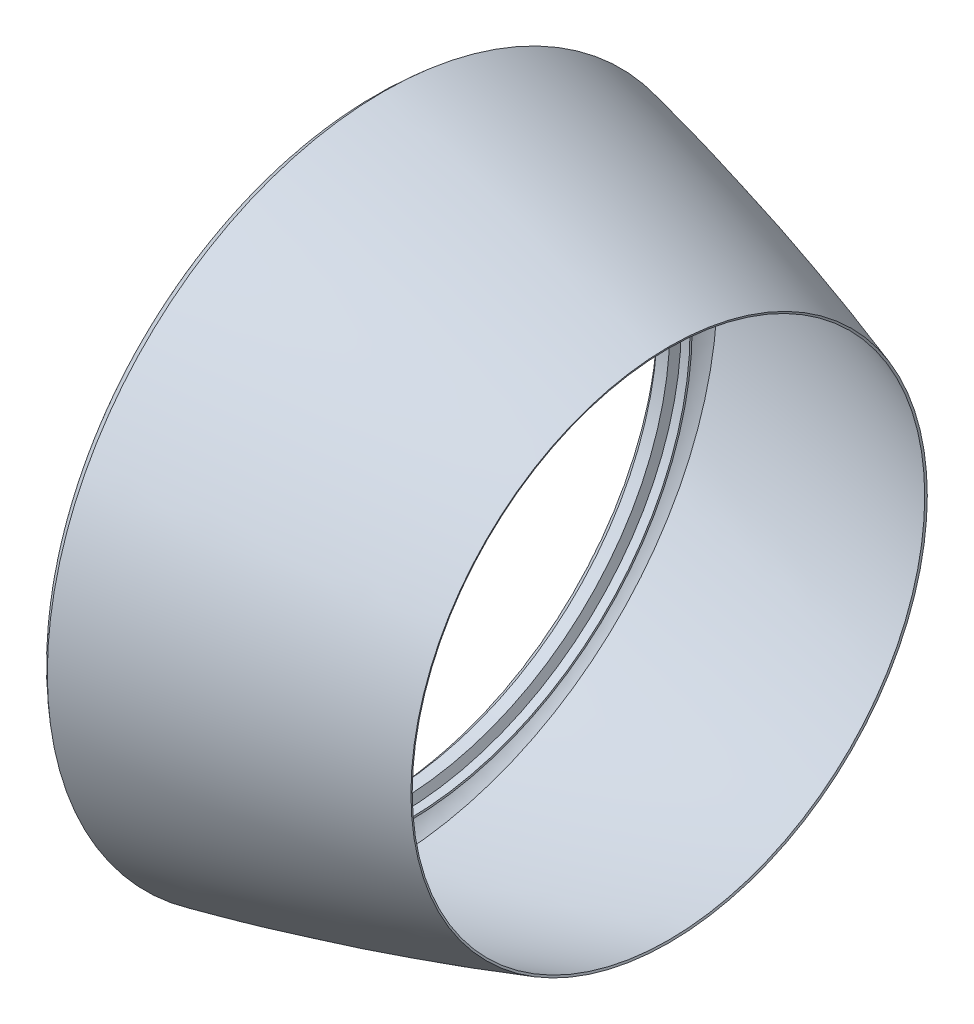
ISO-10303-21;
HEADER;
FILE_DESCRIPTION(('STEP AP214'),'2;1');
FILE_NAME('part.step','',(''),(''),'','','');
FILE_SCHEMA(('AUTOMOTIVE_DESIGN { 1 0 10303 214 1 1 1 1 }'));
ENDSEC;
DATA;
#1=APPLICATION_CONTEXT('core data for automotive mechanical design processes');
#2=APPLICATION_PROTOCOL_DEFINITION('international standard','automotive_design',2000,#1);
#3=PRODUCT_CONTEXT('',#1,'mechanical');
#4=PRODUCT('Part','Part','',(#3));
#5=PRODUCT_RELATED_PRODUCT_CATEGORY('part','',(#4));
#6=PRODUCT_DEFINITION_FORMATION('','',#4);
#7=PRODUCT_DEFINITION_CONTEXT('part definition',#1,'design');
#8=PRODUCT_DEFINITION('design','',#6,#7);
#9=PRODUCT_DEFINITION_SHAPE('','',#8);
#10=(LENGTH_UNIT() NAMED_UNIT(*) SI_UNIT(.MILLI.,.METRE.));
#11=(NAMED_UNIT(*) PLANE_ANGLE_UNIT() SI_UNIT($,.RADIAN.));
#12=(NAMED_UNIT(*) SI_UNIT($,.STERADIAN.) SOLID_ANGLE_UNIT());
#13=UNCERTAINTY_MEASURE_WITH_UNIT(LENGTH_MEASURE(1.E-05),#10,'distance_accuracy_value','');
#14=(GEOMETRIC_REPRESENTATION_CONTEXT(3) GLOBAL_UNCERTAINTY_ASSIGNED_CONTEXT((#13)) GLOBAL_UNIT_ASSIGNED_CONTEXT((#10,
#11,#12)) REPRESENTATION_CONTEXT('',''));
#15=CARTESIAN_POINT('',(0.,0.,0.));
#16=DIRECTION('',(0.,0.,1.));
#17=DIRECTION('',(1.,0.,0.));
#18=AXIS2_PLACEMENT_3D('',#15,#16,#17);
#19=CARTESIAN_POINT('',(58.1645223558109,0.,0.));
#20=DIRECTION('',(-1.,0.,0.));
#21=DIRECTION('',(0.,0.,1.));
#22=AXIS2_PLACEMENT_3D('',#19,#20,#21);
#23=PLANE('',#22);
#24=CARTESIAN_POINT('',(58.1645223558109,0.,0.));
#25=DIRECTION('',(1.,0.,0.));
#26=DIRECTION('',(0.,0.,-1.));
#27=AXIS2_PLACEMENT_3D('',#24,#25,#26);
#28=CIRCLE('',#27,695.);
#29=CARTESIAN_POINT('',(58.1645223558109,0.,-695.));
#30=VERTEX_POINT('',#29);
#31=EDGE_CURVE('E51',#30,#30,#28,.T.);
#32=ORIENTED_EDGE('',*,*,#31,.F.);
#33=EDGE_LOOP('',(#32));
#34=FACE_BOUND('',#33,.T.);
#35=CARTESIAN_POINT('',(58.1645223558109,0.,0.));
#36=DIRECTION('',(1.,0.,0.));
#37=DIRECTION('',(0.,0.,-1.));
#38=AXIS2_PLACEMENT_3D('',#35,#36,#37);
#39=CIRCLE('',#38,700.);
#40=CARTESIAN_POINT('',(58.1645223558109,0.,-700.));
#41=VERTEX_POINT('',#40);
#42=EDGE_CURVE('E114',#41,#41,#39,.T.);
#43=ORIENTED_EDGE('',*,*,#42,.T.);
#44=EDGE_LOOP('',(#43));
#45=FACE_BOUND('',#44,.T.);
#46=ADVANCED_FACE('F33',(#34,#45),#23,.F.);
#47=CARTESIAN_POINT('',(700.,0.,0.));
#48=DIRECTION('',(1.,0.,0.));
#49=DIRECTION('',(0.,0.,-1.));
#50=AXIS2_PLACEMENT_3D('',#47,#48,#49);
#51=CONICAL_SURFACE('',#50,630.,1.25034413133825);
#52=CARTESIAN_POINT('',(701.574978841917,0.,0.));
#53=DIRECTION('',(1.,0.,0.));
#54=DIRECTION('',(0.,1.,0.));
#55=AXIS2_PLACEMENT_3D('',#52,#53,#54);
#56=CIRCLE('',#55,634.745465377338);
#57=CARTESIAN_POINT('',(701.574978841917,634.745465377338,0.));
#58=VERTEX_POINT('',#57);
#59=EDGE_CURVE('E10',#58,#58,#56,.T.);
#60=ORIENTED_EDGE('',*,*,#59,.T.);
#61=EDGE_LOOP('',(#60));
#62=FACE_BOUND('',#61,.T.);
#63=CARTESIAN_POINT('',(700.,0.,0.));
#64=DIRECTION('',(1.,0.,0.));
#65=DIRECTION('',(0.,0.,-1.));
#66=AXIS2_PLACEMENT_3D('',#63,#64,#65);
#67=CIRCLE('',#66,630.);
#68=CARTESIAN_POINT('',(700.,0.,-630.));
#69=VERTEX_POINT('',#68);
#70=EDGE_CURVE('E36',#69,#69,#67,.T.);
#71=ORIENTED_EDGE('',*,*,#70,.F.);
#72=EDGE_LOOP('',(#71));
#73=FACE_BOUND('',#72,.T.);
#74=ADVANCED_FACE('F150',(#62,#73),#51,.F.);
#75=CARTESIAN_POINT('',(700.,630.,0.));
#76=CARTESIAN_POINT('',(355.230240406116,744.42609597077,0.));
#77=CARTESIAN_POINT('',(-3.55230240406116,821.163523456643,0.));
#78=CARTESIAN_POINT('',(-7.10460480812233,821.923299966404,0.));
#79=B_SPLINE_CURVE_WITH_KNOTS('',2,(#75,#76,#77,#78),.UNSPECIFIED.,.F.,.F.,(3,1,3),(0.,1.,1.01),.UNSPECIFIED.);
#80=CARTESIAN_POINT('',(0.,0.,0.));
#81=DIRECTION('',(1.,0.,0.));
#82=AXIS1_PLACEMENT('',#80,#81);
#83=SURFACE_OF_REVOLUTION('',#79,#82);
#84=OFFSET_SURFACE('',#83,-5.,.F.);
#85=CARTESIAN_POINT('',(-1.27214763729724,0.,0.));
#86=DIRECTION('',(1.,0.,0.));
#87=DIRECTION('',(0.,0.,-1.));
#88=AXIS2_PLACEMENT_3D('',#85,#86,#87);
#89=CIRCLE('',#88,825.788923317944);
#90=CARTESIAN_POINT('',(-1.27214763729724,0.,-825.788923317944));
#91=VERTEX_POINT('',#90);
#92=EDGE_CURVE('E40',#91,#91,#89,.T.);
#93=ORIENTED_EDGE('',*,*,#92,.T.);
#94=EDGE_LOOP('',(#93));
#95=FACE_BOUND('',#94,.T.);
#96=ORIENTED_EDGE('',*,*,#59,.F.);
#97=EDGE_LOOP('',(#96));
#98=FACE_BOUND('',#97,.T.);
#99=ADVANCED_FACE('F70',(#95,#98),#84,.F.);
#100=CARTESIAN_POINT('',(1.85103209677286,821.884342886106,0.));
#101=CARTESIAN_POINT('',(0.925516048386431,821.144044916494,0.));
#102=CARTESIAN_POINT('',(-82.2230250655234,754.635531887298,0.));
#103=CARTESIAN_POINT('',(0.822230250655234,679.253644681127,0.));
#104=CARTESIAN_POINT('',(1.64446050131047,678.507289362254,0.));
#105=B_SPLINE_CURVE_WITH_KNOTS('',2,(#100,#101,#102,#103,#104),.UNSPECIFIED.,.F.,.F.,(3,1,1,3),
(-0.0112561663554569,0.,1.,1.01),.UNSPECIFIED.);
#106=CARTESIAN_POINT('',(0.,0.,0.));
#107=DIRECTION('',(1.,0.,0.));
#108=AXIS1_PLACEMENT('',#106,#107);
#109=SURFACE_OF_REVOLUTION('',#105,#108);
#110=OFFSET_SURFACE('',#109,-5.,.F.);
#111=CARTESIAN_POINT('',(-1.93087718880677,0.,0.));
#112=DIRECTION('',(1.,0.,0.));
#113=DIRECTION('',(0.,0.,-1.));
#114=AXIS2_PLACEMENT_3D('',#111,#112,#113);
#115=CIRCLE('',#114,675.);
#116=CARTESIAN_POINT('',(-1.93087718880677,0.,-675.));
#117=VERTEX_POINT('',#116);
#118=EDGE_CURVE('E45',#117,#117,#115,.T.);
#119=ORIENTED_EDGE('',*,*,#118,.T.);
#120=EDGE_LOOP('',(#119));
#121=FACE_BOUND('',#120,.T.);
#122=ORIENTED_EDGE('',*,*,#92,.F.);
#123=EDGE_LOOP('',(#122));
#124=FACE_BOUND('',#123,.T.);
#125=ADVANCED_FACE('F71',(#121,#124),#110,.F.);
#126=CARTESIAN_POINT('',(0.,0.,0.));
#127=DIRECTION('',(1.,0.,0.));
#128=DIRECTION('',(0.,0.,-1.));
#129=AXIS2_PLACEMENT_3D('',#126,#127,#128);
#130=CYLINDRICAL_SURFACE('',#129,675.);
#131=CARTESIAN_POINT('',(28.3594447582819,0.,0.));
#132=DIRECTION('',(1.,0.,0.));
#133=DIRECTION('',(0.,0.,-1.));
#134=AXIS2_PLACEMENT_3D('',#131,#132,#133);
#135=CIRCLE('',#134,675.);
#136=CARTESIAN_POINT('',(28.3594447582819,0.,-675.));
#137=VERTEX_POINT('',#136);
#138=EDGE_CURVE('E54',#137,#137,#135,.T.);
#139=ORIENTED_EDGE('',*,*,#138,.T.);
#140=EDGE_LOOP('',(#139));
#141=FACE_BOUND('',#140,.T.);
#142=ORIENTED_EDGE('',*,*,#118,.F.);
#143=EDGE_LOOP('',(#142));
#144=FACE_BOUND('',#143,.T.);
#145=ADVANCED_FACE('F74',(#141,#144),#130,.F.);
#146=CARTESIAN_POINT('',(29.6291364146602,0.,0.));
#147=DIRECTION('',(1.,0.,0.));
#148=DIRECTION('',(0.,0.,-1.));
#149=AXIS2_PLACEMENT_3D('',#146,#147,#148);
#150=CONICAL_SURFACE('',#149,678.11026561272,1.18321864543573);
#151=CARTESIAN_POINT('',(36.5239671140928,0.,0.));
#152=DIRECTION('',(1.,0.,0.));
#153=DIRECTION('',(0.,0.,-1.));
#154=AXIS2_PLACEMENT_3D('',#151,#152,#153);
#155=CIRCLE('',#154,695.);
#156=CARTESIAN_POINT('',(36.5239671140928,0.,-695.));
#157=VERTEX_POINT('',#156);
#158=EDGE_CURVE('E49',#157,#157,#155,.T.);
#159=ORIENTED_EDGE('',*,*,#158,.T.);
#160=EDGE_LOOP('',(#159));
#161=FACE_BOUND('',#160,.T.);
#162=ORIENTED_EDGE('',*,*,#138,.F.);
#163=EDGE_LOOP('',(#162));
#164=FACE_BOUND('',#163,.T.);
#165=ADVANCED_FACE('F80',(#161,#164),#150,.F.);
#166=CARTESIAN_POINT('',(0.,0.,0.));
#167=DIRECTION('',(1.,0.,0.));
#168=DIRECTION('',(0.,0.,-1.));
#169=AXIS2_PLACEMENT_3D('',#166,#167,#168);
#170=CYLINDRICAL_SURFACE('',#169,695.);
#171=ORIENTED_EDGE('',*,*,#31,.T.);
#172=EDGE_LOOP('',(#171));
#173=FACE_BOUND('',#172,.T.);
#174=ORIENTED_EDGE('',*,*,#158,.F.);
#175=EDGE_LOOP('',(#174));
#176=FACE_BOUND('',#175,.T.);
#177=ADVANCED_FACE('F84',(#173,#176),#170,.F.);
#178=CARTESIAN_POINT('',(700.,630.,0.));
#179=CARTESIAN_POINT('',(355.230240406116,744.42609597077,0.));
#180=CARTESIAN_POINT('',(0.,820.403746946882,0.));
#181=B_SPLINE_CURVE_WITH_KNOTS('',2,(#178,#179,#180),.UNSPECIFIED.,.F.,.F.,(3,3),(0.,1.),.UNSPECIFIED.);
#182=CARTESIAN_POINT('',(0.,0.,0.));
#183=DIRECTION('',(1.,0.,0.));
#184=AXIS1_PLACEMENT('',#182,#183);
#185=SURFACE_OF_REVOLUTION('',#181,#184);
#186=CARTESIAN_POINT('',(0.,0.,0.));
#187=DIRECTION('',(1.,0.,0.));
#188=DIRECTION('',(0.,0.,-1.));
#189=AXIS2_PLACEMENT_3D('',#186,#187,#188);
#190=CIRCLE('',#189,820.403746946882);
#191=CARTESIAN_POINT('',(0.,0.,-820.403746946882));
#192=VERTEX_POINT('',#191);
#193=EDGE_CURVE('E128',#192,#192,#190,.T.);
#194=ORIENTED_EDGE('',*,*,#193,.F.);
#195=EDGE_LOOP('',(#194));
#196=FACE_BOUND('',#195,.T.);
#197=ORIENTED_EDGE('',*,*,#70,.T.);
#198=EDGE_LOOP('',(#197));
#199=FACE_BOUND('',#198,.T.);
#200=ADVANCED_FACE('F88',(#196,#199),#185,.T.);
#201=CARTESIAN_POINT('',(0.,820.403746946882,0.));
#202=CARTESIAN_POINT('',(-82.2230250655234,754.635531887298,0.));
#203=CARTESIAN_POINT('',(0.,680.,0.));
#204=B_SPLINE_CURVE_WITH_KNOTS('',2,(#201,#202,#203),.UNSPECIFIED.,.F.,.F.,(3,3),(0.,1.),.UNSPECIFIED.);
#205=CARTESIAN_POINT('',(0.,0.,0.));
#206=DIRECTION('',(1.,0.,0.));
#207=AXIS1_PLACEMENT('',#205,#206);
#208=SURFACE_OF_REVOLUTION('',#204,#207);
#209=CARTESIAN_POINT('',(0.,0.,0.));
#210=DIRECTION('',(1.,0.,0.));
#211=DIRECTION('',(0.,0.,-1.));
#212=AXIS2_PLACEMENT_3D('',#209,#210,#211);
#213=CIRCLE('',#212,680.);
#214=CARTESIAN_POINT('',(0.,0.,-680.));
#215=VERTEX_POINT('',#214);
#216=EDGE_CURVE('E126',#215,#215,#213,.T.);
#217=ORIENTED_EDGE('',*,*,#216,.F.);
#218=EDGE_LOOP('',(#217));
#219=FACE_BOUND('',#218,.T.);
#220=ORIENTED_EDGE('',*,*,#193,.T.);
#221=EDGE_LOOP('',(#220));
#222=FACE_BOUND('',#221,.T.);
#223=ADVANCED_FACE('F101',(#219,#222),#208,.T.);
#224=CARTESIAN_POINT('',(0.,0.,0.));
#225=DIRECTION('',(1.,0.,0.));
#226=DIRECTION('',(0.,0.,-1.));
#227=AXIS2_PLACEMENT_3D('',#224,#225,#226);
#228=CYLINDRICAL_SURFACE('',#227,680.);
#229=CARTESIAN_POINT('',(25.,0.,0.));
#230=DIRECTION('',(1.,0.,0.));
#231=DIRECTION('',(0.,0.,-1.));
#232=AXIS2_PLACEMENT_3D('',#229,#230,#231);
#233=CIRCLE('',#232,680.);
#234=CARTESIAN_POINT('',(25.,0.,-680.));
#235=VERTEX_POINT('',#234);
#236=EDGE_CURVE('E120',#235,#235,#233,.T.);
#237=ORIENTED_EDGE('',*,*,#236,.F.);
#238=EDGE_LOOP('',(#237));
#239=FACE_BOUND('',#238,.T.);
#240=ORIENTED_EDGE('',*,*,#216,.T.);
#241=EDGE_LOOP('',(#240));
#242=FACE_BOUND('',#241,.T.);
#243=ADVANCED_FACE('F97',(#239,#242),#228,.T.);
#244=CARTESIAN_POINT('',(25.,0.,0.));
#245=DIRECTION('',(1.,0.,0.));
#246=DIRECTION('',(0.,0.,-1.));
#247=AXIS2_PLACEMENT_3D('',#244,#245,#246);
#248=CONICAL_SURFACE('',#247,680.,1.18321864543573);
#249=CARTESIAN_POINT('',(33.1645223558109,0.,0.));
#250=DIRECTION('',(1.,0.,0.));
#251=DIRECTION('',(0.,0.,-1.));
#252=AXIS2_PLACEMENT_3D('',#249,#250,#251);
#253=CIRCLE('',#252,700.);
#254=CARTESIAN_POINT('',(33.1645223558109,0.,-700.));
#255=VERTEX_POINT('',#254);
#256=EDGE_CURVE('E121',#255,#255,#253,.T.);
#257=ORIENTED_EDGE('',*,*,#256,.F.);
#258=EDGE_LOOP('',(#257));
#259=FACE_BOUND('',#258,.T.);
#260=ORIENTED_EDGE('',*,*,#236,.T.);
#261=EDGE_LOOP('',(#260));
#262=FACE_BOUND('',#261,.T.);
#263=ADVANCED_FACE('F93',(#259,#262),#248,.T.);
#264=CARTESIAN_POINT('',(0.,0.,0.));
#265=DIRECTION('',(1.,0.,0.));
#266=DIRECTION('',(0.,0.,-1.));
#267=AXIS2_PLACEMENT_3D('',#264,#265,#266);
#268=CYLINDRICAL_SURFACE('',#267,700.);
#269=ORIENTED_EDGE('',*,*,#42,.F.);
#270=EDGE_LOOP('',(#269));
#271=FACE_BOUND('',#270,.T.);
#272=ORIENTED_EDGE('',*,*,#256,.T.);
#273=EDGE_LOOP('',(#272));
#274=FACE_BOUND('',#273,.T.);
#275=ADVANCED_FACE('F90',(#271,#274),#268,.T.);
#276=CLOSED_SHELL('',(#46,#74,#99,#125,#145,#165,#177,#200,#223,#243,#263,#275));
#277=MANIFOLD_SOLID_BREP('B2',#276);
#278=ADVANCED_BREP_SHAPE_REPRESENTATION('',(#18,#277),#14);
#279=SHAPE_DEFINITION_REPRESENTATION(#9,#278);
ENDSEC;
END-ISO-10303-21;
